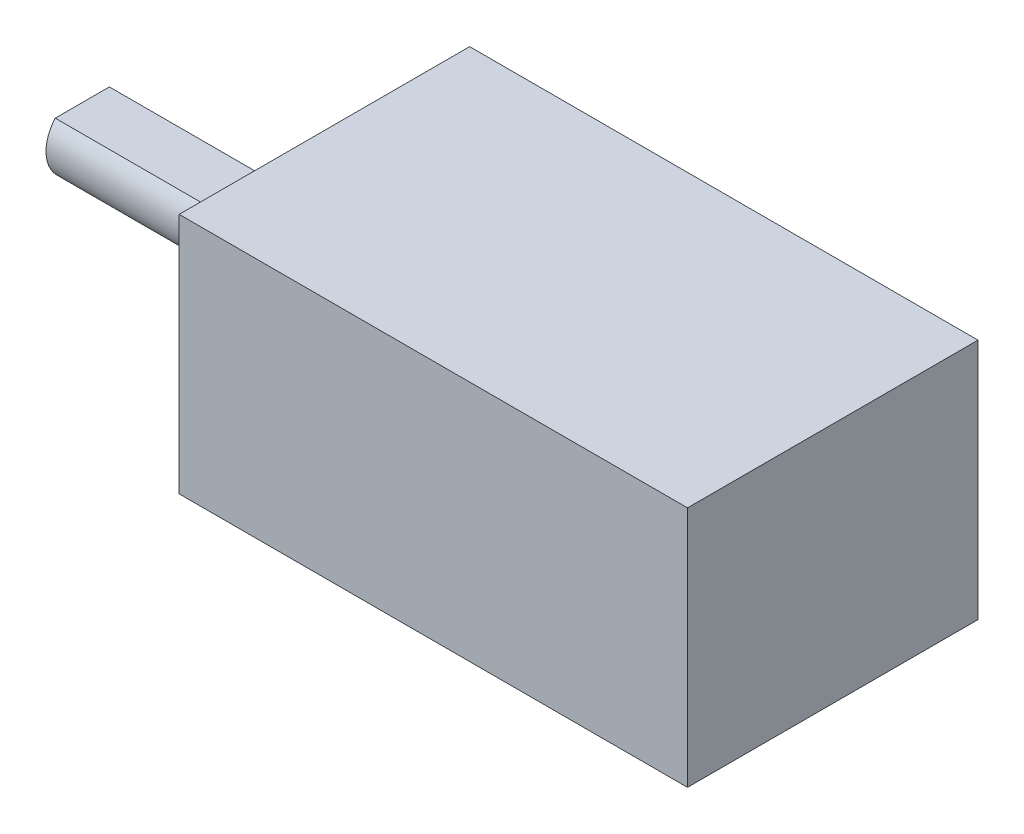
ISO-10303-21;
HEADER;
FILE_DESCRIPTION(('STEP AP214'),'2;1');
FILE_NAME('part.step','',(''),(''),'','','');
FILE_SCHEMA(('AUTOMOTIVE_DESIGN { 1 0 10303 214 1 1 1 1 }'));
ENDSEC;
DATA;
#1=APPLICATION_CONTEXT('core data for automotive mechanical design processes');
#2=APPLICATION_PROTOCOL_DEFINITION('international standard','automotive_design',2000,#1);
#3=PRODUCT_CONTEXT('',#1,'mechanical');
#4=PRODUCT('Part','Part','',(#3));
#5=PRODUCT_RELATED_PRODUCT_CATEGORY('part','',(#4));
#6=PRODUCT_DEFINITION_FORMATION('','',#4);
#7=PRODUCT_DEFINITION_CONTEXT('part definition',#1,'design');
#8=PRODUCT_DEFINITION('design','',#6,#7);
#9=PRODUCT_DEFINITION_SHAPE('','',#8);
#10=(LENGTH_UNIT() NAMED_UNIT(*) SI_UNIT(.MILLI.,.METRE.));
#11=(NAMED_UNIT(*) PLANE_ANGLE_UNIT() SI_UNIT($,.RADIAN.));
#12=(NAMED_UNIT(*) SI_UNIT($,.STERADIAN.) SOLID_ANGLE_UNIT());
#13=UNCERTAINTY_MEASURE_WITH_UNIT(LENGTH_MEASURE(1.E-05),#10,'distance_accuracy_value','');
#14=(GEOMETRIC_REPRESENTATION_CONTEXT(3) GLOBAL_UNCERTAINTY_ASSIGNED_CONTEXT((#13)) GLOBAL_UNIT_ASSIGNED_CONTEXT((#10,
#11,#12)) REPRESENTATION_CONTEXT('',''));
#15=CARTESIAN_POINT('',(0.,0.,0.));
#16=DIRECTION('',(0.,0.,1.));
#17=DIRECTION('',(1.,0.,0.));
#18=AXIS2_PLACEMENT_3D('',#15,#16,#17);
#19=CARTESIAN_POINT('',(0.,10.,0.));
#20=DIRECTION('',(1.,0.,0.));
#21=DIRECTION('',(0.,0.,-1.));
#22=AXIS2_PLACEMENT_3D('',#19,#20,#21);
#23=PLANE('',#22);
#24=DIRECTION('',(0.,0.,1.));
#25=VECTOR('',#24,1.);
#26=CARTESIAN_POINT('',(0.,0.,0.));
#27=LINE('',#26,#25);
#28=CARTESIAN_POINT('',(0.,0.,-12.));
#29=VERTEX_POINT('',#28);
#30=CARTESIAN_POINT('',(0.,0.,0.));
#31=VERTEX_POINT('',#30);
#32=EDGE_CURVE('E120',#29,#31,#27,.T.);
#33=ORIENTED_EDGE('',*,*,#32,.T.);
#34=DIRECTION('',(0.,-1.,0.));
#35=VECTOR('',#34,1.);
#36=CARTESIAN_POINT('',(0.,10.,0.));
#37=LINE('',#36,#35);
#38=CARTESIAN_POINT('',(0.,10.,0.));
#39=VERTEX_POINT('',#38);
#40=EDGE_CURVE('E11',#39,#31,#37,.T.);
#41=ORIENTED_EDGE('',*,*,#40,.F.);
#42=DIRECTION('',(0.,0.,1.));
#43=VECTOR('',#42,1.);
#44=CARTESIAN_POINT('',(0.,10.,0.));
#45=LINE('',#44,#43);
#46=CARTESIAN_POINT('',(0.,10.,-12.));
#47=VERTEX_POINT('',#46);
#48=EDGE_CURVE('E130',#47,#39,#45,.T.);
#49=ORIENTED_EDGE('',*,*,#48,.F.);
#50=DIRECTION('',(0.,-1.,0.));
#51=VECTOR('',#50,1.);
#52=CARTESIAN_POINT('',(0.,10.,-12.));
#53=LINE('',#52,#51);
#54=EDGE_CURVE('E139',#47,#29,#53,.T.);
#55=ORIENTED_EDGE('',*,*,#54,.T.);
#56=EDGE_LOOP('',(#33,#41,#49,#55));
#57=FACE_BOUND('',#56,.T.);
#58=CARTESIAN_POINT('',(0.,5.,-6.));
#59=DIRECTION('',(-1.,0.,0.));
#60=DIRECTION('',(0.,0.,1.));
#61=AXIS2_PLACEMENT_3D('',#58,#59,#60);
#62=CIRCLE('',#61,1.5);
#63=CARTESIAN_POINT('',(0.,6.,-7.11803398874989));
#64=VERTEX_POINT('',#63);
#65=CARTESIAN_POINT('',(0.,6.,-4.8819660112501));
#66=VERTEX_POINT('',#65);
#67=EDGE_CURVE('E118',#64,#66,#62,.T.);
#68=ORIENTED_EDGE('',*,*,#67,.F.);
#69=DIRECTION('',(0.,0.,-1.));
#70=VECTOR('',#69,1.);
#71=CARTESIAN_POINT('',(0.,6.,-7.11803398874989));
#72=LINE('',#71,#70);
#73=EDGE_CURVE('E53',#66,#64,#72,.T.);
#74=ORIENTED_EDGE('',*,*,#73,.F.);
#75=EDGE_LOOP('',(#68,#74));
#76=FACE_BOUND('',#75,.T.);
#77=ADVANCED_FACE('F39',(#57,#76),#23,.F.);
#78=CARTESIAN_POINT('',(0.,10.,0.));
#79=DIRECTION('',(0.,0.,-1.));
#80=DIRECTION('',(-1.,0.,0.));
#81=AXIS2_PLACEMENT_3D('',#78,#79,#80);
#82=PLANE('',#81);
#83=DIRECTION('',(1.,0.,0.));
#84=VECTOR('',#83,1.);
#85=CARTESIAN_POINT('',(0.,0.,0.));
#86=LINE('',#85,#84);
#87=CARTESIAN_POINT('',(21.,0.,0.));
#88=VERTEX_POINT('',#87);
#89=EDGE_CURVE('E125',#31,#88,#86,.T.);
#90=ORIENTED_EDGE('',*,*,#89,.T.);
#91=DIRECTION('',(0.,-1.,0.));
#92=VECTOR('',#91,1.);
#93=CARTESIAN_POINT('',(21.,10.,0.));
#94=LINE('',#93,#92);
#95=CARTESIAN_POINT('',(21.,10.,0.));
#96=VERTEX_POINT('',#95);
#97=EDGE_CURVE('E47',#96,#88,#94,.T.);
#98=ORIENTED_EDGE('',*,*,#97,.F.);
#99=DIRECTION('',(1.,0.,0.));
#100=VECTOR('',#99,1.);
#101=CARTESIAN_POINT('',(0.,10.,0.));
#102=LINE('',#101,#100);
#103=EDGE_CURVE('E90',#39,#96,#102,.T.);
#104=ORIENTED_EDGE('',*,*,#103,.F.);
#105=ORIENTED_EDGE('',*,*,#40,.T.);
#106=EDGE_LOOP('',(#90,#98,#104,#105));
#107=FACE_BOUND('',#106,.T.);
#108=ADVANCED_FACE('F174',(#107),#82,.F.);
#109=CARTESIAN_POINT('',(21.,10.,0.));
#110=DIRECTION('',(-1.,0.,0.));
#111=DIRECTION('',(0.,0.,1.));
#112=AXIS2_PLACEMENT_3D('',#109,#110,#111);
#113=PLANE('',#112);
#114=DIRECTION('',(0.,0.,-1.));
#115=VECTOR('',#114,1.);
#116=CARTESIAN_POINT('',(21.,0.,0.));
#117=LINE('',#116,#115);
#118=CARTESIAN_POINT('',(21.,0.,-12.));
#119=VERTEX_POINT('',#118);
#120=EDGE_CURVE('E143',#88,#119,#117,.T.);
#121=ORIENTED_EDGE('',*,*,#120,.T.);
#122=DIRECTION('',(0.,-1.,0.));
#123=VECTOR('',#122,1.);
#124=CARTESIAN_POINT('',(21.,10.,-12.));
#125=LINE('',#124,#123);
#126=CARTESIAN_POINT('',(21.,10.,-12.));
#127=VERTEX_POINT('',#126);
#128=EDGE_CURVE('E150',#127,#119,#125,.T.);
#129=ORIENTED_EDGE('',*,*,#128,.F.);
#130=DIRECTION('',(0.,0.,-1.));
#131=VECTOR('',#130,1.);
#132=CARTESIAN_POINT('',(21.,10.,0.));
#133=LINE('',#132,#131);
#134=EDGE_CURVE('E135',#96,#127,#133,.T.);
#135=ORIENTED_EDGE('',*,*,#134,.F.);
#136=ORIENTED_EDGE('',*,*,#97,.T.);
#137=EDGE_LOOP('',(#121,#129,#135,#136));
#138=FACE_BOUND('',#137,.T.);
#139=ADVANCED_FACE('F157',(#138),#113,.F.);
#140=CARTESIAN_POINT('',(0.,10.,-12.));
#141=DIRECTION('',(0.,0.,1.));
#142=DIRECTION('',(1.,0.,0.));
#143=AXIS2_PLACEMENT_3D('',#140,#141,#142);
#144=PLANE('',#143);
#145=DIRECTION('',(-1.,0.,0.));
#146=VECTOR('',#145,1.);
#147=CARTESIAN_POINT('',(0.,0.,-12.));
#148=LINE('',#147,#146);
#149=EDGE_CURVE('E83',#119,#29,#148,.T.);
#150=ORIENTED_EDGE('',*,*,#149,.T.);
#151=ORIENTED_EDGE('',*,*,#54,.F.);
#152=DIRECTION('',(-1.,0.,0.));
#153=VECTOR('',#152,1.);
#154=CARTESIAN_POINT('',(0.,10.,-12.));
#155=LINE('',#154,#153);
#156=EDGE_CURVE('E62',#127,#47,#155,.T.);
#157=ORIENTED_EDGE('',*,*,#156,.F.);
#158=ORIENTED_EDGE('',*,*,#128,.T.);
#159=EDGE_LOOP('',(#150,#151,#157,#158));
#160=FACE_BOUND('',#159,.T.);
#161=ADVANCED_FACE('F165',(#160),#144,.F.);
#162=CARTESIAN_POINT('',(0.,10.,0.));
#163=DIRECTION('',(0.,-1.,0.));
#164=DIRECTION('',(0.,0.,-1.));
#165=AXIS2_PLACEMENT_3D('',#162,#163,#164);
#166=PLANE('',#165);
#167=ORIENTED_EDGE('',*,*,#48,.T.);
#168=ORIENTED_EDGE('',*,*,#103,.T.);
#169=ORIENTED_EDGE('',*,*,#134,.T.);
#170=ORIENTED_EDGE('',*,*,#156,.T.);
#171=EDGE_LOOP('',(#167,#168,#169,#170));
#172=FACE_BOUND('',#171,.T.);
#173=ADVANCED_FACE('F167',(#172),#166,.F.);
#174=CARTESIAN_POINT('',(0.,0.,0.));
#175=DIRECTION('',(0.,-1.,0.));
#176=DIRECTION('',(0.,0.,-1.));
#177=AXIS2_PLACEMENT_3D('',#174,#175,#176);
#178=PLANE('',#177);
#179=ORIENTED_EDGE('',*,*,#32,.F.);
#180=ORIENTED_EDGE('',*,*,#149,.F.);
#181=ORIENTED_EDGE('',*,*,#120,.F.);
#182=ORIENTED_EDGE('',*,*,#89,.F.);
#183=EDGE_LOOP('',(#179,#180,#181,#182));
#184=FACE_BOUND('',#183,.T.);
#185=ADVANCED_FACE('F161',(#184),#178,.T.);
#186=CARTESIAN_POINT('',(-10.,5.,-6.));
#187=DIRECTION('',(1.,0.,0.));
#188=DIRECTION('',(0.,0.,-1.));
#189=AXIS2_PLACEMENT_3D('',#186,#187,#188);
#190=CYLINDRICAL_SURFACE('',#189,1.5);
#191=ORIENTED_EDGE('',*,*,#67,.T.);
#192=DIRECTION('',(1.,0.,0.));
#193=VECTOR('',#192,1.);
#194=CARTESIAN_POINT('',(-10.,6.,-4.8819660112501));
#195=LINE('',#194,#193);
#196=CARTESIAN_POINT('',(-10.,6.,-4.8819660112501));
#197=VERTEX_POINT('',#196);
#198=EDGE_CURVE('E104',#197,#66,#195,.T.);
#199=ORIENTED_EDGE('',*,*,#198,.F.);
#200=CARTESIAN_POINT('',(-10.,5.,-6.));
#201=DIRECTION('',(-1.,0.,0.));
#202=DIRECTION('',(0.,0.,1.));
#203=AXIS2_PLACEMENT_3D('',#200,#201,#202);
#204=CIRCLE('',#203,1.5);
#205=CARTESIAN_POINT('',(-10.,6.,-7.11803398874989));
#206=VERTEX_POINT('',#205);
#207=EDGE_CURVE('E111',#206,#197,#204,.T.);
#208=ORIENTED_EDGE('',*,*,#207,.F.);
#209=DIRECTION('',(1.,0.,0.));
#210=VECTOR('',#209,1.);
#211=CARTESIAN_POINT('',(-10.,6.,-7.11803398874989));
#212=LINE('',#211,#210);
#213=EDGE_CURVE('E107',#206,#64,#212,.T.);
#214=ORIENTED_EDGE('',*,*,#213,.T.);
#215=EDGE_LOOP('',(#191,#199,#208,#214));
#216=FACE_BOUND('',#215,.T.);
#217=ADVANCED_FACE('F117',(#216),#190,.T.);
#218=CARTESIAN_POINT('',(-10.,6.,-7.11803398874989));
#219=DIRECTION('',(0.,-1.,0.));
#220=DIRECTION('',(0.,0.,-1.));
#221=AXIS2_PLACEMENT_3D('',#218,#219,#220);
#222=PLANE('',#221);
#223=ORIENTED_EDGE('',*,*,#73,.T.);
#224=ORIENTED_EDGE('',*,*,#213,.F.);
#225=DIRECTION('',(0.,0.,-1.));
#226=VECTOR('',#225,1.);
#227=CARTESIAN_POINT('',(-10.,6.,-7.11803398874989));
#228=LINE('',#227,#226);
#229=EDGE_CURVE('E100',#197,#206,#228,.T.);
#230=ORIENTED_EDGE('',*,*,#229,.F.);
#231=ORIENTED_EDGE('',*,*,#198,.T.);
#232=EDGE_LOOP('',(#223,#224,#230,#231));
#233=FACE_BOUND('',#232,.T.);
#234=ADVANCED_FACE('F102',(#233),#222,.F.);
#235=CARTESIAN_POINT('',(-10.,5.,-6.));
#236=DIRECTION('',(-1.,0.,0.));
#237=DIRECTION('',(0.,0.,1.));
#238=AXIS2_PLACEMENT_3D('',#235,#236,#237);
#239=PLANE('',#238);
#240=ORIENTED_EDGE('',*,*,#207,.T.);
#241=ORIENTED_EDGE('',*,*,#229,.T.);
#242=EDGE_LOOP('',(#240,#241));
#243=FACE_BOUND('',#242,.T.);
#244=ADVANCED_FACE('F113',(#243),#239,.T.);
#245=CLOSED_SHELL('',(#77,#108,#139,#161,#173,#185,#217,#234,#244));
#246=MANIFOLD_SOLID_BREP('B2',#245);
#247=ADVANCED_BREP_SHAPE_REPRESENTATION('',(#18,#246),#14);
#248=SHAPE_DEFINITION_REPRESENTATION(#9,#247);
ENDSEC;
END-ISO-10303-21;
